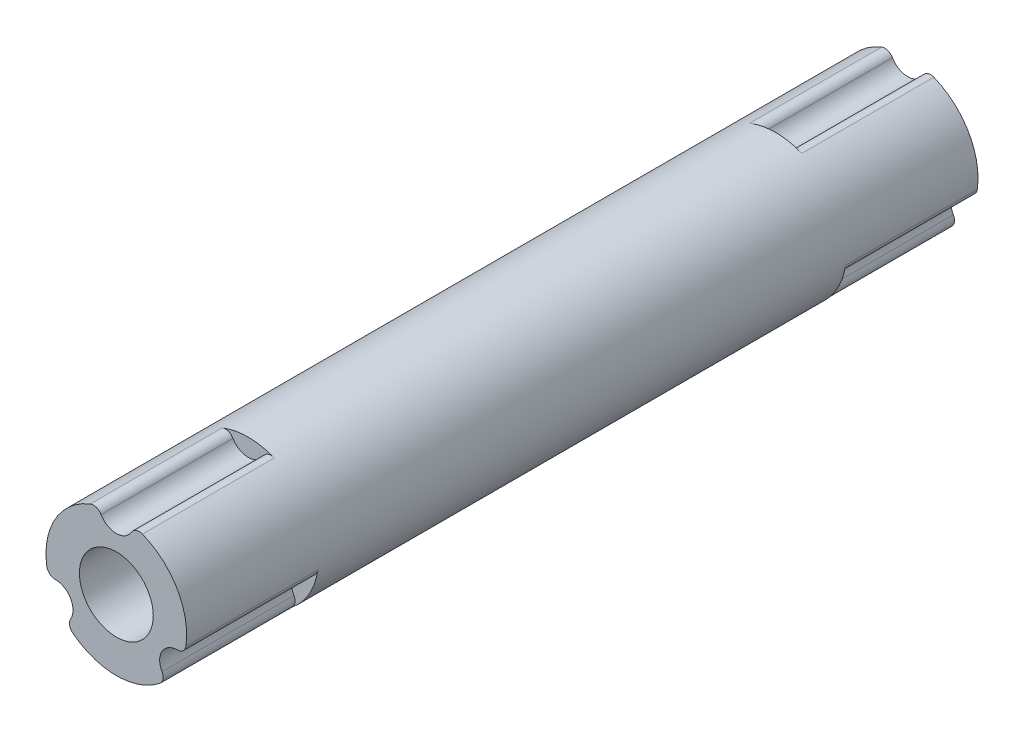
ISO-10303-21;
HEADER;
FILE_DESCRIPTION(('STEP AP214'),'2;1');
FILE_NAME('part.step','',(''),(''),'','','');
FILE_SCHEMA(('AUTOMOTIVE_DESIGN { 1 0 10303 214 1 1 1 1 }'));
ENDSEC;
DATA;
#1=APPLICATION_CONTEXT('core data for automotive mechanical design processes');
#2=APPLICATION_PROTOCOL_DEFINITION('international standard','automotive_design',2000,#1);
#3=PRODUCT_CONTEXT('',#1,'mechanical');
#4=PRODUCT('Part','Part','',(#3));
#5=PRODUCT_RELATED_PRODUCT_CATEGORY('part','',(#4));
#6=PRODUCT_DEFINITION_FORMATION('','',#4);
#7=PRODUCT_DEFINITION_CONTEXT('part definition',#1,'design');
#8=PRODUCT_DEFINITION('design','',#6,#7);
#9=PRODUCT_DEFINITION_SHAPE('','',#8);
#10=(LENGTH_UNIT() NAMED_UNIT(*) SI_UNIT(.MILLI.,.METRE.));
#11=(NAMED_UNIT(*) PLANE_ANGLE_UNIT() SI_UNIT($,.RADIAN.));
#12=(NAMED_UNIT(*) SI_UNIT($,.STERADIAN.) SOLID_ANGLE_UNIT());
#13=UNCERTAINTY_MEASURE_WITH_UNIT(LENGTH_MEASURE(1.E-05),#10,'distance_accuracy_value','');
#14=(GEOMETRIC_REPRESENTATION_CONTEXT(3) GLOBAL_UNCERTAINTY_ASSIGNED_CONTEXT((#13)) GLOBAL_UNIT_ASSIGNED_CONTEXT((#10,
#11,#12)) REPRESENTATION_CONTEXT('',''));
#15=CARTESIAN_POINT('',(0.,0.,0.));
#16=DIRECTION('',(0.,0.,1.));
#17=DIRECTION('',(1.,0.,0.));
#18=AXIS2_PLACEMENT_3D('',#15,#16,#17);
#19=CARTESIAN_POINT('',(-1.29903810567666,3.25,-22.5));
#20=DIRECTION('',(0.,0.,1.));
#21=DIRECTION('',(1.,0.,0.));
#22=AXIS2_PLACEMENT_3D('',#19,#20,#21);
#23=CYLINDRICAL_SURFACE('',#22,0.5);
#24=DIRECTION('',(0.,0.,1.));
#25=VECTOR('',#24,1.);
#26=CARTESIAN_POINT('',(-1.48461497791618,3.71428571428571,-22.5));
#27=LINE('',#26,#25);
#28=CARTESIAN_POINT('',(-1.48461497791618,3.71428571428571,-22.5));
#29=VERTEX_POINT('',#28);
#30=CARTESIAN_POINT('',(-1.48461497791618,3.71428571428572,-15.));
#31=VERTEX_POINT('',#30);
#32=EDGE_CURVE('E228',#29,#31,#27,.T.);
#33=ORIENTED_EDGE('',*,*,#32,.T.);
#34=CARTESIAN_POINT('',(-1.29903810567666,3.25,-15.));
#35=DIRECTION('',(0.,0.,1.));
#36=DIRECTION('',(1.,0.,0.));
#37=AXIS2_PLACEMENT_3D('',#34,#35,#36);
#38=CIRCLE('',#37,0.5);
#39=CARTESIAN_POINT('',(-0.866025403784439,3.5,-15.));
#40=VERTEX_POINT('',#39);
#41=EDGE_CURVE('E447',#31,#40,#38,.F.);
#42=ORIENTED_EDGE('',*,*,#41,.T.);
#43=DIRECTION('',(0.,0.,1.));
#44=VECTOR('',#43,1.);
#45=CARTESIAN_POINT('',(-0.866025403784439,3.5,-22.5));
#46=LINE('',#45,#44);
#47=CARTESIAN_POINT('',(-0.866025403784439,3.5,-22.5));
#48=VERTEX_POINT('',#47);
#49=EDGE_CURVE('E229',#48,#40,#46,.T.);
#50=ORIENTED_EDGE('',*,*,#49,.F.);
#51=CARTESIAN_POINT('',(-1.29903810567666,3.25,-22.5));
#52=DIRECTION('',(0.,0.,1.));
#53=DIRECTION('',(1.,0.,0.));
#54=AXIS2_PLACEMENT_3D('',#51,#52,#53);
#55=CIRCLE('',#54,0.5);
#56=EDGE_CURVE('E321',#48,#29,#55,.T.);
#57=ORIENTED_EDGE('',*,*,#56,.T.);
#58=EDGE_LOOP('',(#33,#42,#50,#57));
#59=FACE_BOUND('',#58,.T.);
#60=ADVANCED_FACE('F39',(#59),#23,.T.);
#61=CARTESIAN_POINT('',(0.,4.,-22.5));
#62=DIRECTION('',(0.,0.,1.));
#63=DIRECTION('',(1.,0.,0.));
#64=AXIS2_PLACEMENT_3D('',#61,#62,#63);
#65=CYLINDRICAL_SURFACE('',#64,1.);
#66=ORIENTED_EDGE('',*,*,#49,.T.);
#67=CARTESIAN_POINT('',(0.,4.,-15.));
#68=DIRECTION('',(0.,0.,1.));
#69=DIRECTION('',(1.,0.,0.));
#70=AXIS2_PLACEMENT_3D('',#67,#68,#69);
#71=CIRCLE('',#70,1.);
#72=CARTESIAN_POINT('',(0.866025403784439,3.5,-15.));
#73=VERTEX_POINT('',#72);
#74=EDGE_CURVE('E444',#40,#73,#71,.T.);
#75=ORIENTED_EDGE('',*,*,#74,.T.);
#76=DIRECTION('',(0.,0.,1.));
#77=VECTOR('',#76,1.);
#78=CARTESIAN_POINT('',(0.866025403784439,3.5,-22.5));
#79=LINE('',#78,#77);
#80=CARTESIAN_POINT('',(0.866025403784439,3.5,-22.5));
#81=VERTEX_POINT('',#80);
#82=EDGE_CURVE('E237',#81,#73,#79,.T.);
#83=ORIENTED_EDGE('',*,*,#82,.F.);
#84=CARTESIAN_POINT('',(0.,4.,-22.5));
#85=DIRECTION('',(0.,0.,-1.));
#86=DIRECTION('',(1.,0.,0.));
#87=AXIS2_PLACEMENT_3D('',#84,#85,#86);
#88=CIRCLE('',#87,1.);
#89=EDGE_CURVE('E318',#81,#48,#88,.T.);
#90=ORIENTED_EDGE('',*,*,#89,.T.);
#91=EDGE_LOOP('',(#66,#75,#83,#90));
#92=FACE_BOUND('',#91,.T.);
#93=ADVANCED_FACE('F480',(#92),#65,.F.);
#94=CARTESIAN_POINT('',(1.29903810567666,3.25,-22.5));
#95=DIRECTION('',(0.,0.,1.));
#96=DIRECTION('',(1.,0.,0.));
#97=AXIS2_PLACEMENT_3D('',#94,#95,#96);
#98=CYLINDRICAL_SURFACE('',#97,0.5);
#99=ORIENTED_EDGE('',*,*,#82,.T.);
#100=CARTESIAN_POINT('',(1.29903810567666,3.25,-15.));
#101=DIRECTION('',(0.,0.,1.));
#102=DIRECTION('',(1.,0.,0.));
#103=AXIS2_PLACEMENT_3D('',#100,#101,#102);
#104=CIRCLE('',#103,0.5);
#105=CARTESIAN_POINT('',(1.48461497791618,3.71428571428571,-15.));
#106=VERTEX_POINT('',#105);
#107=EDGE_CURVE('E441',#73,#106,#104,.F.);
#108=ORIENTED_EDGE('',*,*,#107,.T.);
#109=DIRECTION('',(0.,0.,1.));
#110=VECTOR('',#109,1.);
#111=CARTESIAN_POINT('',(1.48461497791618,3.71428571428571,-22.5));
#112=LINE('',#111,#110);
#113=CARTESIAN_POINT('',(1.48461497791618,3.71428571428571,-22.5));
#114=VERTEX_POINT('',#113);
#115=EDGE_CURVE('E241',#114,#106,#112,.T.);
#116=ORIENTED_EDGE('',*,*,#115,.F.);
#117=CARTESIAN_POINT('',(1.29903810567666,3.25,-22.5));
#118=DIRECTION('',(0.,0.,1.));
#119=DIRECTION('',(-1.,0.,0.));
#120=AXIS2_PLACEMENT_3D('',#117,#118,#119);
#121=CIRCLE('',#120,0.5);
#122=EDGE_CURVE('E315',#114,#81,#121,.T.);
#123=ORIENTED_EDGE('',*,*,#122,.T.);
#124=EDGE_LOOP('',(#99,#108,#116,#123));
#125=FACE_BOUND('',#124,.T.);
#126=ADVANCED_FACE('F486',(#125),#98,.T.);
#127=CARTESIAN_POINT('',(3.46410161513775,-0.500000000000017,-22.5));
#128=DIRECTION('',(0.,0.,1.));
#129=DIRECTION('',(1.,0.,0.));
#130=AXIS2_PLACEMENT_3D('',#127,#128,#129);
#131=CYLINDRICAL_SURFACE('',#130,0.5);
#132=DIRECTION('',(0.,0.,1.));
#133=VECTOR('',#132,1.);
#134=CARTESIAN_POINT('',(3.95897327444315,-0.57142857142859,-22.5));
#135=LINE('',#134,#133);
#136=CARTESIAN_POINT('',(3.95897327444315,-0.57142857142859,-22.5));
#137=VERTEX_POINT('',#136);
#138=CARTESIAN_POINT('',(3.95897327444314,-0.571428571428588,-15.));
#139=VERTEX_POINT('',#138);
#140=EDGE_CURVE('E296',#137,#139,#135,.T.);
#141=ORIENTED_EDGE('',*,*,#140,.T.);
#142=CARTESIAN_POINT('',(3.46410161513775,-0.500000000000017,-15.));
#143=DIRECTION('',(0.,0.,1.));
#144=DIRECTION('',(1.,0.,0.));
#145=AXIS2_PLACEMENT_3D('',#142,#143,#144);
#146=CIRCLE('',#145,0.5);
#147=CARTESIAN_POINT('',(3.46410161513775,-1.00000000000002,-15.));
#148=VERTEX_POINT('',#147);
#149=EDGE_CURVE('E434',#139,#148,#146,.F.);
#150=ORIENTED_EDGE('',*,*,#149,.T.);
#151=DIRECTION('',(0.,0.,1.));
#152=VECTOR('',#151,1.);
#153=CARTESIAN_POINT('',(3.46410161513775,-1.00000000000002,-22.5));
#154=LINE('',#153,#152);
#155=CARTESIAN_POINT('',(3.46410161513775,-1.00000000000002,-22.5));
#156=VERTEX_POINT('',#155);
#157=EDGE_CURVE('E301',#156,#148,#154,.T.);
#158=ORIENTED_EDGE('',*,*,#157,.F.);
#159=CARTESIAN_POINT('',(3.46410161513775,-0.500000000000017,-22.5));
#160=DIRECTION('',(0.,0.,1.));
#161=DIRECTION('',(-0.500000000000004,-0.866025403784436,0.));
#162=AXIS2_PLACEMENT_3D('',#159,#160,#161);
#163=CIRCLE('',#162,0.5);
#164=EDGE_CURVE('E280',#156,#137,#163,.T.);
#165=ORIENTED_EDGE('',*,*,#164,.T.);
#166=EDGE_LOOP('',(#141,#150,#158,#165));
#167=FACE_BOUND('',#166,.T.);
#168=ADVANCED_FACE('F510',(#167),#131,.T.);
#169=CARTESIAN_POINT('',(3.46410161513775,-2.00000000000002,-22.5));
#170=DIRECTION('',(0.,0.,1.));
#171=DIRECTION('',(1.,0.,0.));
#172=AXIS2_PLACEMENT_3D('',#169,#170,#171);
#173=CYLINDRICAL_SURFACE('',#172,1.);
#174=ORIENTED_EDGE('',*,*,#157,.T.);
#175=CARTESIAN_POINT('',(3.46410161513775,-2.00000000000002,-15.));
#176=DIRECTION('',(0.,0.,1.));
#177=DIRECTION('',(1.,0.,0.));
#178=AXIS2_PLACEMENT_3D('',#175,#176,#177);
#179=CIRCLE('',#178,1.);
#180=CARTESIAN_POINT('',(2.5980762113533,-2.50000000000001,-15.));
#181=VERTEX_POINT('',#180);
#182=EDGE_CURVE('E431',#148,#181,#179,.T.);
#183=ORIENTED_EDGE('',*,*,#182,.T.);
#184=DIRECTION('',(0.,0.,1.));
#185=VECTOR('',#184,1.);
#186=CARTESIAN_POINT('',(2.5980762113533,-2.50000000000001,-22.5));
#187=LINE('',#186,#185);
#188=CARTESIAN_POINT('',(2.5980762113533,-2.50000000000001,-22.5));
#189=VERTEX_POINT('',#188);
#190=EDGE_CURVE('E305',#189,#181,#187,.T.);
#191=ORIENTED_EDGE('',*,*,#190,.F.);
#192=CARTESIAN_POINT('',(3.46410161513775,-2.00000000000002,-22.5));
#193=DIRECTION('',(0.,0.,-1.));
#194=DIRECTION('',(-0.500000000000004,-0.866025403784436,0.));
#195=AXIS2_PLACEMENT_3D('',#192,#193,#194);
#196=CIRCLE('',#195,1.);
#197=EDGE_CURVE('E277',#189,#156,#196,.T.);
#198=ORIENTED_EDGE('',*,*,#197,.T.);
#199=EDGE_LOOP('',(#174,#183,#191,#198));
#200=FACE_BOUND('',#199,.T.);
#201=ADVANCED_FACE('F516',(#200),#173,.F.);
#202=CARTESIAN_POINT('',(2.16506350946108,-2.75000000000001,-22.5));
#203=DIRECTION('',(0.,0.,1.));
#204=DIRECTION('',(1.,0.,0.));
#205=AXIS2_PLACEMENT_3D('',#202,#203,#204);
#206=CYLINDRICAL_SURFACE('',#205,0.5);
#207=ORIENTED_EDGE('',*,*,#190,.T.);
#208=CARTESIAN_POINT('',(2.16506350946108,-2.75000000000001,-15.));
#209=DIRECTION('',(0.,0.,1.));
#210=DIRECTION('',(1.,0.,0.));
#211=AXIS2_PLACEMENT_3D('',#208,#209,#210);
#212=CIRCLE('',#211,0.5);
#213=CARTESIAN_POINT('',(2.47435829652695,-3.14285714285715,-15.));
#214=VERTEX_POINT('',#213);
#215=EDGE_CURVE('E428',#181,#214,#212,.F.);
#216=ORIENTED_EDGE('',*,*,#215,.T.);
#217=DIRECTION('',(0.,0.,1.));
#218=VECTOR('',#217,1.);
#219=CARTESIAN_POINT('',(2.47435829652695,-3.14285714285715,-22.5));
#220=LINE('',#219,#218);
#221=CARTESIAN_POINT('',(2.47435829652695,-3.14285714285715,-22.5));
#222=VERTEX_POINT('',#221);
#223=EDGE_CURVE('E309',#222,#214,#220,.T.);
#224=ORIENTED_EDGE('',*,*,#223,.F.);
#225=CARTESIAN_POINT('',(2.16506350946108,-2.75000000000001,-22.5));
#226=DIRECTION('',(0.,0.,1.));
#227=DIRECTION('',(0.500000000000004,0.866025403784436,0.));
#228=AXIS2_PLACEMENT_3D('',#225,#226,#227);
#229=CIRCLE('',#228,0.5);
#230=EDGE_CURVE('E273',#222,#189,#229,.T.);
#231=ORIENTED_EDGE('',*,*,#230,.T.);
#232=EDGE_LOOP('',(#207,#216,#224,#231));
#233=FACE_BOUND('',#232,.T.);
#234=ADVANCED_FACE('F427',(#233),#206,.T.);
#235=CARTESIAN_POINT('',(-2.16506350946112,-2.74999999999998,-22.5));
#236=DIRECTION('',(0.,0.,1.));
#237=DIRECTION('',(1.,0.,0.));
#238=AXIS2_PLACEMENT_3D('',#235,#236,#237);
#239=CYLINDRICAL_SURFACE('',#238,0.5);
#240=DIRECTION('',(0.,0.,1.));
#241=VECTOR('',#240,1.);
#242=CARTESIAN_POINT('',(-2.474358296527,-3.14285714285712,-22.5));
#243=LINE('',#242,#241);
#244=CARTESIAN_POINT('',(-2.474358296527,-3.14285714285712,-22.5));
#245=VERTEX_POINT('',#244);
#246=CARTESIAN_POINT('',(-2.474358296527,-3.14285714285712,-15.));
#247=VERTEX_POINT('',#246);
#248=EDGE_CURVE('E288',#245,#247,#243,.T.);
#249=ORIENTED_EDGE('',*,*,#248,.T.);
#250=CARTESIAN_POINT('',(-2.16506350946112,-2.74999999999998,-15.));
#251=DIRECTION('',(0.,0.,1.));
#252=DIRECTION('',(1.,0.,0.));
#253=AXIS2_PLACEMENT_3D('',#250,#251,#252);
#254=CIRCLE('',#253,0.5);
#255=CARTESIAN_POINT('',(-2.59807621135334,-2.49999999999998,-15.));
#256=VERTEX_POINT('',#255);
#257=EDGE_CURVE('E432',#247,#256,#254,.F.);
#258=ORIENTED_EDGE('',*,*,#257,.T.);
#259=DIRECTION('',(0.,0.,1.));
#260=VECTOR('',#259,1.);
#261=CARTESIAN_POINT('',(-2.59807621135334,-2.49999999999998,-22.5));
#262=LINE('',#261,#260);
#263=CARTESIAN_POINT('',(-2.59807621135334,-2.49999999999998,-22.5));
#264=VERTEX_POINT('',#263);
#265=EDGE_CURVE('E360',#264,#256,#262,.T.);
#266=ORIENTED_EDGE('',*,*,#265,.F.);
#267=CARTESIAN_POINT('',(-2.16506350946112,-2.74999999999998,-22.5));
#268=DIRECTION('',(0.,0.,1.));
#269=DIRECTION('',(-0.499999999999992,0.866025403784443,0.));
#270=AXIS2_PLACEMENT_3D('',#267,#268,#269);
#271=CIRCLE('',#270,0.5);
#272=EDGE_CURVE('E267',#264,#245,#271,.T.);
#273=ORIENTED_EDGE('',*,*,#272,.T.);
#274=EDGE_LOOP('',(#249,#258,#266,#273));
#275=FACE_BOUND('',#274,.T.);
#276=ADVANCED_FACE('F416',(#275),#239,.T.);
#277=CARTESIAN_POINT('',(-3.46410161513777,-1.99999999999997,-22.5));
#278=DIRECTION('',(0.,0.,1.));
#279=DIRECTION('',(1.,0.,0.));
#280=AXIS2_PLACEMENT_3D('',#277,#278,#279);
#281=CYLINDRICAL_SURFACE('',#280,1.);
#282=ORIENTED_EDGE('',*,*,#265,.T.);
#283=CARTESIAN_POINT('',(-3.46410161513777,-1.99999999999997,-15.));
#284=DIRECTION('',(0.,0.,1.));
#285=DIRECTION('',(1.,0.,0.));
#286=AXIS2_PLACEMENT_3D('',#283,#284,#285);
#287=CIRCLE('',#286,1.);
#288=CARTESIAN_POINT('',(-3.46410161513776,-0.999999999999968,-15.));
#289=VERTEX_POINT('',#288);
#290=EDGE_CURVE('E210',#256,#289,#287,.T.);
#291=ORIENTED_EDGE('',*,*,#290,.T.);
#292=DIRECTION('',(0.,0.,1.));
#293=VECTOR('',#292,1.);
#294=CARTESIAN_POINT('',(-3.46410161513776,-0.999999999999968,-22.5));
#295=LINE('',#294,#293);
#296=CARTESIAN_POINT('',(-3.46410161513776,-0.999999999999968,-22.5));
#297=VERTEX_POINT('',#296);
#298=EDGE_CURVE('E253',#297,#289,#295,.T.);
#299=ORIENTED_EDGE('',*,*,#298,.F.);
#300=CARTESIAN_POINT('',(-3.46410161513777,-1.99999999999997,-22.5));
#301=DIRECTION('',(0.,0.,-1.));
#302=DIRECTION('',(-0.499999999999992,0.866025403784443,0.));
#303=AXIS2_PLACEMENT_3D('',#300,#301,#302);
#304=CIRCLE('',#303,1.);
#305=EDGE_CURVE('E411',#297,#264,#304,.T.);
#306=ORIENTED_EDGE('',*,*,#305,.T.);
#307=EDGE_LOOP('',(#282,#291,#299,#306));
#308=FACE_BOUND('',#307,.T.);
#309=ADVANCED_FACE('F459',(#308),#281,.F.);
#310=CARTESIAN_POINT('',(-3.46410161513776,-0.499999999999968,-22.5));
#311=DIRECTION('',(0.,0.,1.));
#312=DIRECTION('',(1.,0.,0.));
#313=AXIS2_PLACEMENT_3D('',#310,#311,#312);
#314=CYLINDRICAL_SURFACE('',#313,0.5);
#315=ORIENTED_EDGE('',*,*,#298,.T.);
#316=CARTESIAN_POINT('',(-3.46410161513776,-0.499999999999968,-15.));
#317=DIRECTION('',(0.,0.,1.));
#318=DIRECTION('',(1.,0.,0.));
#319=AXIS2_PLACEMENT_3D('',#316,#317,#318);
#320=CIRCLE('',#319,0.5);
#321=CARTESIAN_POINT('',(-3.95897327444316,-0.571428571428536,-15.));
#322=VERTEX_POINT('',#321);
#323=EDGE_CURVE('E47',#289,#322,#320,.F.);
#324=ORIENTED_EDGE('',*,*,#323,.T.);
#325=DIRECTION('',(0.,0.,1.));
#326=VECTOR('',#325,1.);
#327=CARTESIAN_POINT('',(-3.95897327444315,-0.571428571428535,-22.5));
#328=LINE('',#327,#326);
#329=CARTESIAN_POINT('',(-3.95897327444315,-0.571428571428535,-22.5));
#330=VERTEX_POINT('',#329);
#331=EDGE_CURVE('E251',#330,#322,#328,.T.);
#332=ORIENTED_EDGE('',*,*,#331,.F.);
#333=CARTESIAN_POINT('',(-3.46410161513776,-0.499999999999968,-22.5));
#334=DIRECTION('',(0.,0.,1.));
#335=DIRECTION('',(0.499999999999992,-0.866025403784443,0.));
#336=AXIS2_PLACEMENT_3D('',#333,#334,#335);
#337=CIRCLE('',#336,0.5);
#338=EDGE_CURVE('E358',#330,#297,#337,.T.);
#339=ORIENTED_EDGE('',*,*,#338,.T.);
#340=EDGE_LOOP('',(#315,#324,#332,#339));
#341=FACE_BOUND('',#340,.T.);
#342=ADVANCED_FACE('F249',(#341),#314,.T.);
#343=CARTESIAN_POINT('',(0.,0.,-22.5));
#344=DIRECTION('',(0.,0.,1.));
#345=DIRECTION('',(1.,0.,0.));
#346=AXIS2_PLACEMENT_3D('',#343,#344,#345);
#347=CYLINDRICAL_SURFACE('',#346,4.);
#348=CARTESIAN_POINT('',(-1.48461497791618,3.71428571428572,15.));
#349=VERTEX_POINT('',#348);
#350=CARTESIAN_POINT('',(-1.48461497791618,3.71428571428571,22.5));
#351=VERTEX_POINT('',#350);
#352=EDGE_CURVE('E217',#349,#351,#27,.T.);
#353=ORIENTED_EDGE('',*,*,#352,.F.);
#354=CARTESIAN_POINT('',(0.,0.,15.));
#355=DIRECTION('',(0.,0.,1.));
#356=DIRECTION('',(1.,0.,0.));
#357=AXIS2_PLACEMENT_3D('',#354,#355,#356);
#358=CIRCLE('',#357,4.);
#359=CARTESIAN_POINT('',(1.48461497791618,3.71428571428571,15.));
#360=VERTEX_POINT('',#359);
#361=EDGE_CURVE('E54',#360,#349,#358,.T.);
#362=ORIENTED_EDGE('',*,*,#361,.F.);
#363=CARTESIAN_POINT('',(1.48461497791618,3.71428571428571,22.5));
#364=VERTEX_POINT('',#363);
#365=EDGE_CURVE('E243',#360,#364,#112,.T.);
#366=ORIENTED_EDGE('',*,*,#365,.T.);
#367=CARTESIAN_POINT('',(0.,0.,22.5));
#368=DIRECTION('',(0.,0.,1.));
#369=DIRECTION('',(1.,0.,0.));
#370=AXIS2_PLACEMENT_3D('',#367,#368,#369);
#371=CIRCLE('',#370,4.);
#372=CARTESIAN_POINT('',(3.95897327444315,-0.57142857142859,22.5));
#373=VERTEX_POINT('',#372);
#374=EDGE_CURVE('E299',#373,#364,#371,.T.);
#375=ORIENTED_EDGE('',*,*,#374,.F.);
#376=CARTESIAN_POINT('',(3.95897327444314,-0.571428571428588,15.));
#377=VERTEX_POINT('',#376);
#378=EDGE_CURVE('E300',#377,#373,#135,.T.);
#379=ORIENTED_EDGE('',*,*,#378,.F.);
#380=CARTESIAN_POINT('',(2.47435829652695,-3.14285714285715,15.));
#381=VERTEX_POINT('',#380);
#382=EDGE_CURVE('E61',#381,#377,#358,.T.);
#383=ORIENTED_EDGE('',*,*,#382,.F.);
#384=CARTESIAN_POINT('',(2.47435829652695,-3.14285714285715,22.5));
#385=VERTEX_POINT('',#384);
#386=EDGE_CURVE('E283',#381,#385,#220,.T.);
#387=ORIENTED_EDGE('',*,*,#386,.T.);
#388=CARTESIAN_POINT('',(0.,0.,22.5));
#389=DIRECTION('',(0.,0.,1.));
#390=DIRECTION('',(-0.500000000000004,-0.866025403784436,0.));
#391=AXIS2_PLACEMENT_3D('',#388,#389,#390);
#392=CIRCLE('',#391,4.);
#393=CARTESIAN_POINT('',(-2.474358296527,-3.14285714285712,22.5));
#394=VERTEX_POINT('',#393);
#395=EDGE_CURVE('E284',#394,#385,#392,.T.);
#396=ORIENTED_EDGE('',*,*,#395,.F.);
#397=CARTESIAN_POINT('',(-2.474358296527,-3.14285714285712,15.));
#398=VERTEX_POINT('',#397);
#399=EDGE_CURVE('E359',#398,#394,#243,.T.);
#400=ORIENTED_EDGE('',*,*,#399,.F.);
#401=CARTESIAN_POINT('',(-3.95897327444315,-0.571428571428535,15.));
#402=VERTEX_POINT('',#401);
#403=EDGE_CURVE('E211',#402,#398,#358,.T.);
#404=ORIENTED_EDGE('',*,*,#403,.F.);
#405=CARTESIAN_POINT('',(-3.95897327444315,-0.571428571428535,22.5));
#406=VERTEX_POINT('',#405);
#407=EDGE_CURVE('E264',#402,#406,#328,.T.);
#408=ORIENTED_EDGE('',*,*,#407,.T.);
#409=CARTESIAN_POINT('',(0.,0.,22.5));
#410=DIRECTION('',(0.,0.,1.));
#411=DIRECTION('',(1.,0.,0.));
#412=AXIS2_PLACEMENT_3D('',#409,#410,#411);
#413=CIRCLE('',#412,4.);
#414=EDGE_CURVE('E226',#351,#406,#413,.T.);
#415=ORIENTED_EDGE('',*,*,#414,.F.);
#416=EDGE_LOOP('',(#353,#362,#366,#375,#379,#383,#387,#396,#400,#404,#408,#415));
#417=FACE_BOUND('',#416,.T.);
#418=CARTESIAN_POINT('',(0.,0.,-15.));
#419=DIRECTION('',(0.,0.,1.));
#420=DIRECTION('',(1.,0.,0.));
#421=AXIS2_PLACEMENT_3D('',#418,#419,#420);
#422=CIRCLE('',#421,4.);
#423=EDGE_CURVE('E457',#106,#31,#422,.T.);
#424=ORIENTED_EDGE('',*,*,#423,.T.);
#425=ORIENTED_EDGE('',*,*,#32,.F.);
#426=CARTESIAN_POINT('',(0.,0.,-22.5));
#427=DIRECTION('',(0.,0.,1.));
#428=DIRECTION('',(1.,0.,0.));
#429=AXIS2_PLACEMENT_3D('',#426,#427,#428);
#430=CIRCLE('',#429,4.);
#431=EDGE_CURVE('E262',#29,#330,#430,.T.);
#432=ORIENTED_EDGE('',*,*,#431,.T.);
#433=ORIENTED_EDGE('',*,*,#331,.T.);
#434=EDGE_CURVE('E259',#322,#247,#422,.T.);
#435=ORIENTED_EDGE('',*,*,#434,.T.);
#436=ORIENTED_EDGE('',*,*,#248,.F.);
#437=CARTESIAN_POINT('',(0.,0.,-22.5));
#438=DIRECTION('',(0.,0.,1.));
#439=DIRECTION('',(-0.500000000000004,-0.866025403784436,0.));
#440=AXIS2_PLACEMENT_3D('',#437,#438,#439);
#441=CIRCLE('',#440,4.);
#442=EDGE_CURVE('E270',#245,#222,#441,.T.);
#443=ORIENTED_EDGE('',*,*,#442,.T.);
#444=ORIENTED_EDGE('',*,*,#223,.T.);
#445=EDGE_CURVE('E424',#214,#139,#422,.T.);
#446=ORIENTED_EDGE('',*,*,#445,.T.);
#447=ORIENTED_EDGE('',*,*,#140,.F.);
#448=CARTESIAN_POINT('',(0.,0.,-22.5));
#449=DIRECTION('',(0.,0.,1.));
#450=DIRECTION('',(1.,0.,0.));
#451=AXIS2_PLACEMENT_3D('',#448,#449,#450);
#452=CIRCLE('',#451,4.);
#453=EDGE_CURVE('E312',#137,#114,#452,.T.);
#454=ORIENTED_EDGE('',*,*,#453,.T.);
#455=ORIENTED_EDGE('',*,*,#115,.T.);
#456=EDGE_LOOP('',(#424,#425,#432,#433,#435,#436,#443,#444,#446,#447,#454,#455));
#457=FACE_BOUND('',#456,.T.);
#458=ADVANCED_FACE('F223',(#417,#457),#347,.T.);
#459=CARTESIAN_POINT('',(-1.29903810567666,3.25,15.));
#460=DIRECTION('',(0.,0.,1.));
#461=DIRECTION('',(1.,0.,0.));
#462=AXIS2_PLACEMENT_3D('',#459,#460,#461);
#463=CIRCLE('',#462,0.5);
#464=CARTESIAN_POINT('',(-0.866025403784439,3.5,15.));
#465=VERTEX_POINT('',#464);
#466=EDGE_CURVE('E205',#349,#465,#463,.F.);
#467=ORIENTED_EDGE('',*,*,#466,.F.);
#468=ORIENTED_EDGE('',*,*,#352,.T.);
#469=CARTESIAN_POINT('',(-1.29903810567666,3.25,22.5));
#470=DIRECTION('',(0.,0.,1.));
#471=DIRECTION('',(1.,0.,0.));
#472=AXIS2_PLACEMENT_3D('',#469,#470,#471);
#473=CIRCLE('',#472,0.5);
#474=CARTESIAN_POINT('',(-0.866025403784439,3.5,22.5));
#475=VERTEX_POINT('',#474);
#476=EDGE_CURVE('E332',#475,#351,#473,.T.);
#477=ORIENTED_EDGE('',*,*,#476,.F.);
#478=EDGE_CURVE('E219',#465,#475,#46,.T.);
#479=ORIENTED_EDGE('',*,*,#478,.F.);
#480=EDGE_LOOP('',(#467,#468,#477,#479));
#481=FACE_BOUND('',#480,.T.);
#482=ADVANCED_FACE('F215',(#481),#23,.T.);
#483=CARTESIAN_POINT('',(0.,4.,15.));
#484=DIRECTION('',(0.,0.,1.));
#485=DIRECTION('',(1.,0.,0.));
#486=AXIS2_PLACEMENT_3D('',#483,#484,#485);
#487=CIRCLE('',#486,1.);
#488=CARTESIAN_POINT('',(0.866025403784439,3.5,15.));
#489=VERTEX_POINT('',#488);
#490=EDGE_CURVE('E221',#465,#489,#487,.T.);
#491=ORIENTED_EDGE('',*,*,#490,.F.);
#492=ORIENTED_EDGE('',*,*,#478,.T.);
#493=CARTESIAN_POINT('',(0.,4.,22.5));
#494=DIRECTION('',(0.,0.,-1.));
#495=DIRECTION('',(1.,0.,0.));
#496=AXIS2_PLACEMENT_3D('',#493,#494,#495);
#497=CIRCLE('',#496,1.);
#498=CARTESIAN_POINT('',(0.866025403784439,3.5,22.5));
#499=VERTEX_POINT('',#498);
#500=EDGE_CURVE('E330',#499,#475,#497,.T.);
#501=ORIENTED_EDGE('',*,*,#500,.F.);
#502=EDGE_CURVE('E240',#489,#499,#79,.T.);
#503=ORIENTED_EDGE('',*,*,#502,.F.);
#504=EDGE_LOOP('',(#491,#492,#501,#503));
#505=FACE_BOUND('',#504,.T.);
#506=ADVANCED_FACE('F399',(#505),#65,.F.);
#507=CARTESIAN_POINT('',(1.29903810567666,3.25,15.));
#508=DIRECTION('',(0.,0.,1.));
#509=DIRECTION('',(1.,0.,0.));
#510=AXIS2_PLACEMENT_3D('',#507,#508,#509);
#511=CIRCLE('',#510,0.5);
#512=EDGE_CURVE('E208',#489,#360,#511,.F.);
#513=ORIENTED_EDGE('',*,*,#512,.F.);
#514=ORIENTED_EDGE('',*,*,#502,.T.);
#515=CARTESIAN_POINT('',(1.29903810567666,3.25,22.5));
#516=DIRECTION('',(0.,0.,1.));
#517=DIRECTION('',(-1.,0.,0.));
#518=AXIS2_PLACEMENT_3D('',#515,#516,#517);
#519=CIRCLE('',#518,0.5);
#520=EDGE_CURVE('E327',#364,#499,#519,.T.);
#521=ORIENTED_EDGE('',*,*,#520,.F.);
#522=ORIENTED_EDGE('',*,*,#365,.F.);
#523=EDGE_LOOP('',(#513,#514,#521,#522));
#524=FACE_BOUND('',#523,.T.);
#525=ADVANCED_FACE('F41',(#524),#98,.T.);
#526=CARTESIAN_POINT('',(0.,0.,-22.5));
#527=DIRECTION('',(0.,0.,1.));
#528=DIRECTION('',(1.,0.,0.));
#529=AXIS2_PLACEMENT_3D('',#526,#527,#528);
#530=PLANE('',#529);
#531=CARTESIAN_POINT('',(0.,0.,-22.5));
#532=DIRECTION('',(0.,0.,-1.));
#533=DIRECTION('',(-1.,0.,0.));
#534=AXIS2_PLACEMENT_3D('',#531,#532,#533);
#535=CIRCLE('',#534,2.09999999999999);
#536=CARTESIAN_POINT('',(-2.09999999999999,0.,-22.5));
#537=VERTEX_POINT('',#536);
#538=EDGE_CURVE('E351',#537,#537,#535,.T.);
#539=ORIENTED_EDGE('',*,*,#538,.F.);
#540=EDGE_LOOP('',(#539));
#541=FACE_BOUND('',#540,.T.);
#542=ORIENTED_EDGE('',*,*,#453,.F.);
#543=ORIENTED_EDGE('',*,*,#164,.F.);
#544=ORIENTED_EDGE('',*,*,#197,.F.);
#545=ORIENTED_EDGE('',*,*,#230,.F.);
#546=ORIENTED_EDGE('',*,*,#442,.F.);
#547=ORIENTED_EDGE('',*,*,#272,.F.);
#548=ORIENTED_EDGE('',*,*,#305,.F.);
#549=ORIENTED_EDGE('',*,*,#338,.F.);
#550=ORIENTED_EDGE('',*,*,#431,.F.);
#551=ORIENTED_EDGE('',*,*,#56,.F.);
#552=ORIENTED_EDGE('',*,*,#89,.F.);
#553=ORIENTED_EDGE('',*,*,#122,.F.);
#554=EDGE_LOOP('',(#542,#543,#544,#545,#546,#547,#548,#549,#550,#551,#552,#553));
#555=FACE_BOUND('',#554,.T.);
#556=ADVANCED_FACE('F419',(#541,#555),#530,.F.);
#557=CARTESIAN_POINT('',(0.,0.,22.5));
#558=DIRECTION('',(0.,0.,1.));
#559=DIRECTION('',(1.,0.,0.));
#560=AXIS2_PLACEMENT_3D('',#557,#558,#559);
#561=PLANE('',#560);
#562=CARTESIAN_POINT('',(0.,0.,22.5));
#563=DIRECTION('',(0.,0.,1.));
#564=DIRECTION('',(1.,0.,0.));
#565=AXIS2_PLACEMENT_3D('',#562,#563,#564);
#566=CIRCLE('',#565,2.09999999999999);
#567=CARTESIAN_POINT('',(2.09999999999999,0.,22.5));
#568=VERTEX_POINT('',#567);
#569=EDGE_CURVE('E220',#568,#568,#566,.T.);
#570=ORIENTED_EDGE('',*,*,#569,.F.);
#571=EDGE_LOOP('',(#570));
#572=FACE_BOUND('',#571,.T.);
#573=CARTESIAN_POINT('',(3.46410161513775,-0.500000000000017,22.5));
#574=DIRECTION('',(0.,0.,1.));
#575=DIRECTION('',(-0.500000000000004,-0.866025403784436,0.));
#576=AXIS2_PLACEMENT_3D('',#573,#574,#575);
#577=CIRCLE('',#576,0.5);
#578=CARTESIAN_POINT('',(3.46410161513775,-1.00000000000002,22.5));
#579=VERTEX_POINT('',#578);
#580=EDGE_CURVE('E274',#579,#373,#577,.T.);
#581=ORIENTED_EDGE('',*,*,#580,.T.);
#582=ORIENTED_EDGE('',*,*,#374,.T.);
#583=ORIENTED_EDGE('',*,*,#520,.T.);
#584=ORIENTED_EDGE('',*,*,#500,.T.);
#585=ORIENTED_EDGE('',*,*,#476,.T.);
#586=ORIENTED_EDGE('',*,*,#414,.T.);
#587=CARTESIAN_POINT('',(-3.46410161513776,-0.499999999999968,22.5));
#588=DIRECTION('',(0.,0.,1.));
#589=DIRECTION('',(0.499999999999992,-0.866025403784443,0.));
#590=AXIS2_PLACEMENT_3D('',#587,#588,#589);
#591=CIRCLE('',#590,0.5);
#592=CARTESIAN_POINT('',(-3.46410161513776,-0.999999999999968,22.5));
#593=VERTEX_POINT('',#592);
#594=EDGE_CURVE('E338',#406,#593,#591,.T.);
#595=ORIENTED_EDGE('',*,*,#594,.T.);
#596=CARTESIAN_POINT('',(-3.46410161513777,-1.99999999999997,22.5));
#597=DIRECTION('',(0.,0.,-1.));
#598=DIRECTION('',(-0.499999999999992,0.866025403784443,0.));
#599=AXIS2_PLACEMENT_3D('',#596,#597,#598);
#600=CIRCLE('',#599,1.);
#601=CARTESIAN_POINT('',(-2.59807621135334,-2.49999999999998,22.5));
#602=VERTEX_POINT('',#601);
#603=EDGE_CURVE('E345',#593,#602,#600,.T.);
#604=ORIENTED_EDGE('',*,*,#603,.T.);
#605=CARTESIAN_POINT('',(-2.16506350946112,-2.74999999999998,22.5));
#606=DIRECTION('',(0.,0.,1.));
#607=DIRECTION('',(-0.499999999999992,0.866025403784443,0.));
#608=AXIS2_PLACEMENT_3D('',#605,#606,#607);
#609=CIRCLE('',#608,0.5);
#610=EDGE_CURVE('E348',#602,#394,#609,.T.);
#611=ORIENTED_EDGE('',*,*,#610,.T.);
#612=ORIENTED_EDGE('',*,*,#395,.T.);
#613=CARTESIAN_POINT('',(2.16506350946108,-2.75000000000001,22.5));
#614=DIRECTION('',(0.,0.,1.));
#615=DIRECTION('',(0.500000000000004,0.866025403784436,0.));
#616=AXIS2_PLACEMENT_3D('',#613,#614,#615);
#617=CIRCLE('',#616,0.5);
#618=CARTESIAN_POINT('',(2.5980762113533,-2.50000000000001,22.5));
#619=VERTEX_POINT('',#618);
#620=EDGE_CURVE('E287',#385,#619,#617,.T.);
#621=ORIENTED_EDGE('',*,*,#620,.T.);
#622=CARTESIAN_POINT('',(3.46410161513775,-2.00000000000002,22.5));
#623=DIRECTION('',(0.,0.,-1.));
#624=DIRECTION('',(-0.500000000000004,-0.866025403784436,0.));
#625=AXIS2_PLACEMENT_3D('',#622,#623,#624);
#626=CIRCLE('',#625,1.);
#627=EDGE_CURVE('E291',#619,#579,#626,.T.);
#628=ORIENTED_EDGE('',*,*,#627,.T.);
#629=EDGE_LOOP('',(#581,#582,#583,#584,#585,#586,#595,#604,#611,#612,#621,#628));
#630=FACE_BOUND('',#629,.T.);
#631=ADVANCED_FACE('F336',(#572,#630),#561,.T.);
#632=CARTESIAN_POINT('',(3.46410161513775,-0.500000000000017,15.));
#633=DIRECTION('',(0.,0.,1.));
#634=DIRECTION('',(1.,0.,0.));
#635=AXIS2_PLACEMENT_3D('',#632,#633,#634);
#636=CIRCLE('',#635,0.5);
#637=CARTESIAN_POINT('',(3.46410161513775,-1.00000000000002,15.));
#638=VERTEX_POINT('',#637);
#639=EDGE_CURVE('E393',#377,#638,#636,.F.);
#640=ORIENTED_EDGE('',*,*,#639,.F.);
#641=ORIENTED_EDGE('',*,*,#378,.T.);
#642=ORIENTED_EDGE('',*,*,#580,.F.);
#643=EDGE_CURVE('E304',#638,#579,#154,.T.);
#644=ORIENTED_EDGE('',*,*,#643,.F.);
#645=EDGE_LOOP('',(#640,#641,#642,#644));
#646=FACE_BOUND('',#645,.T.);
#647=ADVANCED_FACE('F392',(#646),#131,.T.);
#648=CARTESIAN_POINT('',(3.46410161513775,-2.00000000000002,15.));
#649=DIRECTION('',(0.,0.,1.));
#650=DIRECTION('',(1.,0.,0.));
#651=AXIS2_PLACEMENT_3D('',#648,#649,#650);
#652=CIRCLE('',#651,1.);
#653=CARTESIAN_POINT('',(2.5980762113533,-2.50000000000001,15.));
#654=VERTEX_POINT('',#653);
#655=EDGE_CURVE('E454',#638,#654,#652,.T.);
#656=ORIENTED_EDGE('',*,*,#655,.F.);
#657=ORIENTED_EDGE('',*,*,#643,.T.);
#658=ORIENTED_EDGE('',*,*,#627,.F.);
#659=EDGE_CURVE('E308',#654,#619,#187,.T.);
#660=ORIENTED_EDGE('',*,*,#659,.F.);
#661=EDGE_LOOP('',(#656,#657,#658,#660));
#662=FACE_BOUND('',#661,.T.);
#663=ADVANCED_FACE('F386',(#662),#173,.F.);
#664=CARTESIAN_POINT('',(2.16506350946108,-2.75000000000001,15.));
#665=DIRECTION('',(0.,0.,1.));
#666=DIRECTION('',(1.,0.,0.));
#667=AXIS2_PLACEMENT_3D('',#664,#665,#666);
#668=CIRCLE('',#667,0.5);
#669=EDGE_CURVE('E383',#654,#381,#668,.F.);
#670=ORIENTED_EDGE('',*,*,#669,.F.);
#671=ORIENTED_EDGE('',*,*,#659,.T.);
#672=ORIENTED_EDGE('',*,*,#620,.F.);
#673=ORIENTED_EDGE('',*,*,#386,.F.);
#674=EDGE_LOOP('',(#670,#671,#672,#673));
#675=FACE_BOUND('',#674,.T.);
#676=ADVANCED_FACE('F380',(#675),#206,.T.);
#677=CARTESIAN_POINT('',(-2.16506350946112,-2.74999999999998,15.));
#678=DIRECTION('',(0.,0.,1.));
#679=DIRECTION('',(1.,0.,0.));
#680=AXIS2_PLACEMENT_3D('',#677,#678,#679);
#681=CIRCLE('',#680,0.5);
#682=CARTESIAN_POINT('',(-2.59807621135334,-2.49999999999998,15.));
#683=VERTEX_POINT('',#682);
#684=EDGE_CURVE('E451',#398,#683,#681,.F.);
#685=ORIENTED_EDGE('',*,*,#684,.F.);
#686=ORIENTED_EDGE('',*,*,#399,.T.);
#687=ORIENTED_EDGE('',*,*,#610,.F.);
#688=EDGE_CURVE('E362',#683,#602,#262,.T.);
#689=ORIENTED_EDGE('',*,*,#688,.F.);
#690=EDGE_LOOP('',(#685,#686,#687,#689));
#691=FACE_BOUND('',#690,.T.);
#692=ADVANCED_FACE('F373',(#691),#239,.T.);
#693=CARTESIAN_POINT('',(-3.46410161513777,-1.99999999999997,15.));
#694=DIRECTION('',(0.,0.,1.));
#695=DIRECTION('',(1.,0.,0.));
#696=AXIS2_PLACEMENT_3D('',#693,#694,#695);
#697=CIRCLE('',#696,1.);
#698=CARTESIAN_POINT('',(-3.46410161513776,-0.999999999999968,15.));
#699=VERTEX_POINT('',#698);
#700=EDGE_CURVE('E370',#683,#699,#697,.T.);
#701=ORIENTED_EDGE('',*,*,#700,.F.);
#702=ORIENTED_EDGE('',*,*,#688,.T.);
#703=ORIENTED_EDGE('',*,*,#603,.F.);
#704=EDGE_CURVE('E263',#699,#593,#295,.T.);
#705=ORIENTED_EDGE('',*,*,#704,.F.);
#706=EDGE_LOOP('',(#701,#702,#703,#705));
#707=FACE_BOUND('',#706,.T.);
#708=ADVANCED_FACE('F369',(#707),#281,.F.);
#709=CARTESIAN_POINT('',(-3.46410161513776,-0.499999999999968,15.));
#710=DIRECTION('',(0.,0.,1.));
#711=DIRECTION('',(1.,0.,0.));
#712=AXIS2_PLACEMENT_3D('',#709,#710,#711);
#713=CIRCLE('',#712,0.5);
#714=EDGE_CURVE('E11',#699,#402,#713,.F.);
#715=ORIENTED_EDGE('',*,*,#714,.F.);
#716=ORIENTED_EDGE('',*,*,#704,.T.);
#717=ORIENTED_EDGE('',*,*,#594,.F.);
#718=ORIENTED_EDGE('',*,*,#407,.F.);
#719=EDGE_LOOP('',(#715,#716,#717,#718));
#720=FACE_BOUND('',#719,.T.);
#721=ADVANCED_FACE('F342',(#720),#314,.T.);
#722=CARTESIAN_POINT('',(0.,0.,-8.5));
#723=DIRECTION('',(0.,0.,-1.));
#724=DIRECTION('',(-1.,0.,0.));
#725=AXIS2_PLACEMENT_3D('',#722,#723,#724);
#726=CONICAL_SURFACE('',#725,2.1,1.02974425867665);
#727=CARTESIAN_POINT('',(0.,0.,-7.23819270004212));
#728=VERTEX_POINT('',#727);
#729=VERTEX_LOOP('',#728);
#730=FACE_BOUND('',#729,.T.);
#731=CARTESIAN_POINT('',(0.,0.,-8.5));
#732=DIRECTION('',(0.,0.,-1.));
#733=DIRECTION('',(-1.,0.,0.));
#734=AXIS2_PLACEMENT_3D('',#731,#732,#733);
#735=CIRCLE('',#734,2.1);
#736=CARTESIAN_POINT('',(-2.1,0.,-8.5));
#737=VERTEX_POINT('',#736);
#738=EDGE_CURVE('E346',#737,#737,#735,.T.);
#739=ORIENTED_EDGE('',*,*,#738,.T.);
#740=EDGE_LOOP('',(#739));
#741=FACE_BOUND('',#740,.T.);
#742=ADVANCED_FACE('F547',(#730,#741),#726,.F.);
#743=CARTESIAN_POINT('',(0.,0.,-22.5));
#744=DIRECTION('',(0.,0.,-1.));
#745=DIRECTION('',(-1.,0.,0.));
#746=AXIS2_PLACEMENT_3D('',#743,#744,#745);
#747=CYLINDRICAL_SURFACE('',#746,2.09999999999999);
#748=ORIENTED_EDGE('',*,*,#738,.F.);
#749=EDGE_LOOP('',(#748));
#750=FACE_BOUND('',#749,.T.);
#751=ORIENTED_EDGE('',*,*,#538,.T.);
#752=EDGE_LOOP('',(#751));
#753=FACE_BOUND('',#752,.T.);
#754=ADVANCED_FACE('F552',(#750,#753),#747,.F.);
#755=CARTESIAN_POINT('',(0.,0.,8.5));
#756=DIRECTION('',(0.,0.,1.));
#757=DIRECTION('',(1.,0.,0.));
#758=AXIS2_PLACEMENT_3D('',#755,#756,#757);
#759=CONICAL_SURFACE('',#758,2.09999999999999,1.02974425867665);
#760=CARTESIAN_POINT('',(0.,0.,7.23819270004213));
#761=VERTEX_POINT('',#760);
#762=VERTEX_LOOP('',#761);
#763=FACE_BOUND('',#762,.T.);
#764=CARTESIAN_POINT('',(0.,0.,8.5));
#765=DIRECTION('',(0.,0.,1.));
#766=DIRECTION('',(1.,0.,0.));
#767=AXIS2_PLACEMENT_3D('',#764,#765,#766);
#768=CIRCLE('',#767,2.09999999999999);
#769=CARTESIAN_POINT('',(2.09999999999999,0.,8.5));
#770=VERTEX_POINT('',#769);
#771=EDGE_CURVE('E406',#770,#770,#768,.T.);
#772=ORIENTED_EDGE('',*,*,#771,.T.);
#773=EDGE_LOOP('',(#772));
#774=FACE_BOUND('',#773,.T.);
#775=ADVANCED_FACE('F473',(#763,#774),#759,.F.);
#776=CARTESIAN_POINT('',(0.,0.,22.5));
#777=DIRECTION('',(0.,0.,1.));
#778=DIRECTION('',(1.,0.,0.));
#779=AXIS2_PLACEMENT_3D('',#776,#777,#778);
#780=CYLINDRICAL_SURFACE('',#779,2.09999999999999);
#781=ORIENTED_EDGE('',*,*,#771,.F.);
#782=EDGE_LOOP('',(#781));
#783=FACE_BOUND('',#782,.T.);
#784=ORIENTED_EDGE('',*,*,#569,.T.);
#785=EDGE_LOOP('',(#784));
#786=FACE_BOUND('',#785,.T.);
#787=ADVANCED_FACE('F463',(#783,#786),#780,.F.);
#788=CARTESIAN_POINT('',(0.,0.,-15.));
#789=DIRECTION('',(0.,0.,1.));
#790=DIRECTION('',(1.,0.,0.));
#791=AXIS2_PLACEMENT_3D('',#788,#789,#790);
#792=PLANE('',#791);
#793=ORIENTED_EDGE('',*,*,#257,.F.);
#794=ORIENTED_EDGE('',*,*,#434,.F.);
#795=ORIENTED_EDGE('',*,*,#323,.F.);
#796=ORIENTED_EDGE('',*,*,#290,.F.);
#797=EDGE_LOOP('',(#793,#794,#795,#796));
#798=FACE_BOUND('',#797,.T.);
#799=ADVANCED_FACE('F460',(#798),#792,.F.);
#800=CARTESIAN_POINT('',(0.,0.,15.));
#801=DIRECTION('',(0.,0.,1.));
#802=DIRECTION('',(1.,0.,0.));
#803=AXIS2_PLACEMENT_3D('',#800,#801,#802);
#804=PLANE('',#803);
#805=ORIENTED_EDGE('',*,*,#403,.T.);
#806=ORIENTED_EDGE('',*,*,#684,.T.);
#807=ORIENTED_EDGE('',*,*,#700,.T.);
#808=ORIENTED_EDGE('',*,*,#714,.T.);
#809=EDGE_LOOP('',(#805,#806,#807,#808));
#810=FACE_BOUND('',#809,.T.);
#811=ADVANCED_FACE('F462',(#810),#804,.T.);
#812=ORIENTED_EDGE('',*,*,#149,.F.);
#813=ORIENTED_EDGE('',*,*,#445,.F.);
#814=ORIENTED_EDGE('',*,*,#215,.F.);
#815=ORIENTED_EDGE('',*,*,#182,.F.);
#816=EDGE_LOOP('',(#812,#813,#814,#815));
#817=FACE_BOUND('',#816,.T.);
#818=ADVANCED_FACE('F466',(#817),#792,.F.);
#819=ORIENTED_EDGE('',*,*,#382,.T.);
#820=ORIENTED_EDGE('',*,*,#639,.T.);
#821=ORIENTED_EDGE('',*,*,#655,.T.);
#822=ORIENTED_EDGE('',*,*,#669,.T.);
#823=EDGE_LOOP('',(#819,#820,#821,#822));
#824=FACE_BOUND('',#823,.T.);
#825=ADVANCED_FACE('F456',(#824),#804,.T.);
#826=ORIENTED_EDGE('',*,*,#361,.T.);
#827=ORIENTED_EDGE('',*,*,#466,.T.);
#828=ORIENTED_EDGE('',*,*,#490,.T.);
#829=ORIENTED_EDGE('',*,*,#512,.T.);
#830=EDGE_LOOP('',(#826,#827,#828,#829));
#831=FACE_BOUND('',#830,.T.);
#832=ADVANCED_FACE('F204',(#831),#804,.T.);
#833=ORIENTED_EDGE('',*,*,#41,.F.);
#834=ORIENTED_EDGE('',*,*,#423,.F.);
#835=ORIENTED_EDGE('',*,*,#107,.F.);
#836=ORIENTED_EDGE('',*,*,#74,.F.);
#837=EDGE_LOOP('',(#833,#834,#835,#836));
#838=FACE_BOUND('',#837,.T.);
#839=ADVANCED_FACE('F465',(#838),#792,.F.);
#840=CLOSED_SHELL('',(#60,#93,#126,#168,#201,#234,#276,#309,#342,#458,#482,#506,#525,#556,#631,
#647,#663,#676,#692,#708,#721,#742,#754,#775,#787,#799,#811,#818,#825,#832,#839));
#841=MANIFOLD_SOLID_BREP('B2',#840);
#842=ADVANCED_BREP_SHAPE_REPRESENTATION('',(#18,#841),#14);
#843=SHAPE_DEFINITION_REPRESENTATION(#9,#842);
ENDSEC;
END-ISO-10303-21;
